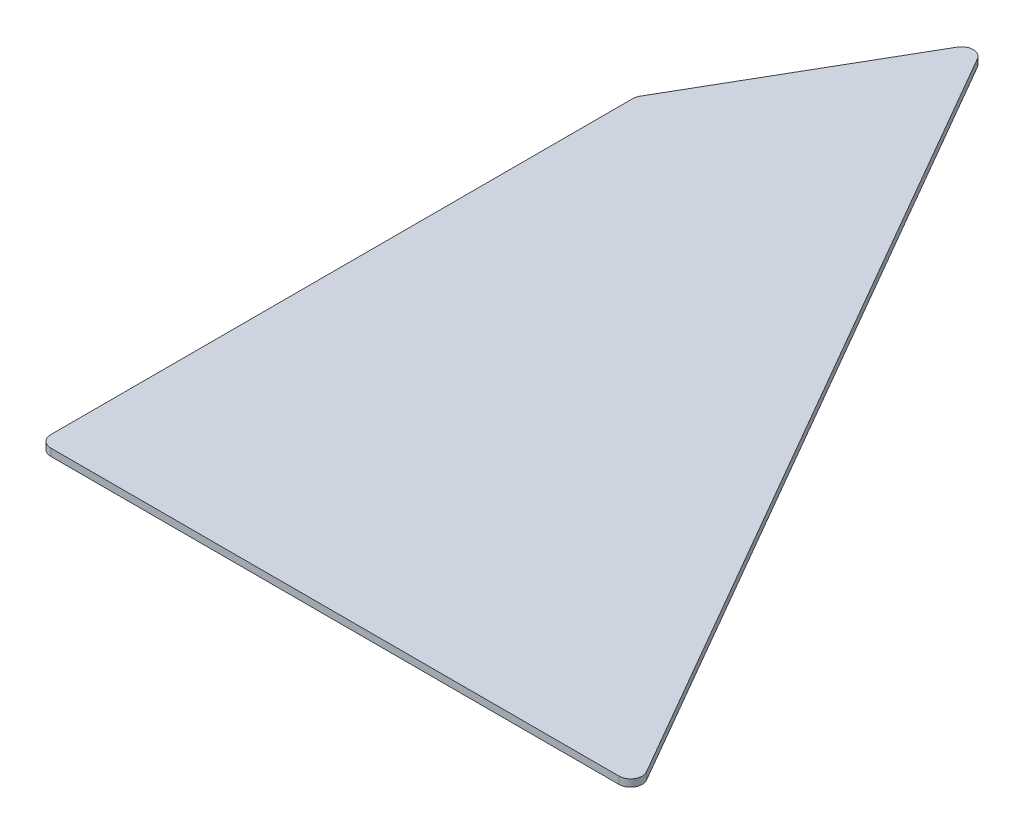
ISO-10303-21;
HEADER;
FILE_DESCRIPTION(('STEP AP214'),'2;1');
FILE_NAME('part.step','',(''),(''),'','','');
FILE_SCHEMA(('AUTOMOTIVE_DESIGN { 1 0 10303 214 1 1 1 1 }'));
ENDSEC;
DATA;
#1=APPLICATION_CONTEXT('core data for automotive mechanical design processes');
#2=APPLICATION_PROTOCOL_DEFINITION('international standard','automotive_design',2000,#1);
#3=PRODUCT_CONTEXT('',#1,'mechanical');
#4=PRODUCT('Part','Part','',(#3));
#5=PRODUCT_RELATED_PRODUCT_CATEGORY('part','',(#4));
#6=PRODUCT_DEFINITION_FORMATION('','',#4);
#7=PRODUCT_DEFINITION_CONTEXT('part definition',#1,'design');
#8=PRODUCT_DEFINITION('design','',#6,#7);
#9=PRODUCT_DEFINITION_SHAPE('','',#8);
#10=(LENGTH_UNIT() NAMED_UNIT(*) SI_UNIT(.MILLI.,.METRE.));
#11=(NAMED_UNIT(*) PLANE_ANGLE_UNIT() SI_UNIT($,.RADIAN.));
#12=(NAMED_UNIT(*) SI_UNIT($,.STERADIAN.) SOLID_ANGLE_UNIT());
#13=UNCERTAINTY_MEASURE_WITH_UNIT(LENGTH_MEASURE(1.E-05),#10,'distance_accuracy_value','');
#14=(GEOMETRIC_REPRESENTATION_CONTEXT(3) GLOBAL_UNCERTAINTY_ASSIGNED_CONTEXT((#13)) GLOBAL_UNIT_ASSIGNED_CONTEXT((#10,
#11,#12)) REPRESENTATION_CONTEXT('',''));
#15=CARTESIAN_POINT('',(0.,0.,0.));
#16=DIRECTION('',(0.,0.,1.));
#17=DIRECTION('',(1.,0.,0.));
#18=AXIS2_PLACEMENT_3D('',#15,#16,#17);
#19=CARTESIAN_POINT('',(172.72,6.35,0.));
#20=DIRECTION('',(-1.,0.,0.));
#21=DIRECTION('',(0.,0.,1.));
#22=AXIS2_PLACEMENT_3D('',#19,#20,#21);
#23=PLANE('',#22);
#24=DIRECTION('',(0.,0.,-1.));
#25=VECTOR('',#24,1.);
#26=CARTESIAN_POINT('',(172.72,6.35,0.));
#27=LINE('',#26,#25);
#28=CARTESIAN_POINT('',(172.72,6.35,-17.78));
#29=VERTEX_POINT('',#28);
#30=CARTESIAN_POINT('',(172.72,6.35,-272.398633585746));
#31=VERTEX_POINT('',#30);
#32=EDGE_CURVE('E132',#29,#31,#27,.T.);
#33=ORIENTED_EDGE('',*,*,#32,.T.);
#34=DIRECTION('',(0.,-1.,0.));
#35=VECTOR('',#34,1.);
#36=CARTESIAN_POINT('',(172.72,3.175,-272.398633585746));
#37=LINE('',#36,#35);
#38=CARTESIAN_POINT('',(172.72,3.175,-272.398633585746));
#39=VERTEX_POINT('',#38);
#40=EDGE_CURVE('E215',#31,#39,#37,.T.);
#41=ORIENTED_EDGE('',*,*,#40,.T.);
#42=DIRECTION('',(0.,0.,-1.));
#43=VECTOR('',#42,1.);
#44=CARTESIAN_POINT('',(172.72,3.175,0.));
#45=LINE('',#44,#43);
#46=CARTESIAN_POINT('',(172.72,3.175,-17.78));
#47=VERTEX_POINT('',#46);
#48=EDGE_CURVE('E158',#47,#39,#45,.T.);
#49=ORIENTED_EDGE('',*,*,#48,.F.);
#50=DIRECTION('',(0.,-1.,0.));
#51=VECTOR('',#50,1.);
#52=CARTESIAN_POINT('',(172.72,6.35,-17.78));
#53=LINE('',#52,#51);
#54=EDGE_CURVE('E213',#47,#29,#53,.F.);
#55=ORIENTED_EDGE('',*,*,#54,.T.);
#56=EDGE_LOOP('',(#33,#41,#49,#55));
#57=FACE_BOUND('',#56,.T.);
#58=ADVANCED_FACE('F33',(#57),#23,.T.);
#59=CARTESIAN_POINT('',(0.,6.35,-12.7));
#60=DIRECTION('',(0.,0.,-1.));
#61=DIRECTION('',(-1.,0.,0.));
#62=AXIS2_PLACEMENT_3D('',#59,#60,#61);
#63=PLANE('',#62);
#64=DIRECTION('',(1.,0.,0.));
#65=VECTOR('',#64,1.);
#66=CARTESIAN_POINT('',(0.,6.35,-12.7));
#67=LINE('',#66,#65);
#68=CARTESIAN_POINT('',(177.8,6.35,-12.7));
#69=VERTEX_POINT('',#68);
#70=CARTESIAN_POINT('',(426.404136641425,6.35,-12.7));
#71=VERTEX_POINT('',#70);
#72=EDGE_CURVE('E180',#69,#71,#67,.T.);
#73=ORIENTED_EDGE('',*,*,#72,.F.);
#74=DIRECTION('',(0.,-1.,0.));
#75=VECTOR('',#74,1.);
#76=CARTESIAN_POINT('',(177.8,3.175,-12.7));
#77=LINE('',#76,#75);
#78=CARTESIAN_POINT('',(177.8,3.175,-12.7));
#79=VERTEX_POINT('',#78);
#80=EDGE_CURVE('E11',#69,#79,#77,.T.);
#81=ORIENTED_EDGE('',*,*,#80,.T.);
#82=DIRECTION('',(1.,0.,0.));
#83=VECTOR('',#82,1.);
#84=CARTESIAN_POINT('',(0.,3.175,-12.7));
#85=LINE('',#84,#83);
#86=CARTESIAN_POINT('',(426.404136641425,3.175,-12.7));
#87=VERTEX_POINT('',#86);
#88=EDGE_CURVE('E161',#79,#87,#85,.T.);
#89=ORIENTED_EDGE('',*,*,#88,.T.);
#90=DIRECTION('',(0.,-1.,0.));
#91=VECTOR('',#90,1.);
#92=CARTESIAN_POINT('',(426.404136641425,6.35,-12.7));
#93=LINE('',#92,#91);
#94=EDGE_CURVE('E41',#87,#71,#93,.F.);
#95=ORIENTED_EDGE('',*,*,#94,.T.);
#96=EDGE_LOOP('',(#73,#81,#89,#95));
#97=FACE_BOUND('',#96,.T.);
#98=ADVANCED_FACE('F228',(#97),#63,.F.);
#99=CARTESIAN_POINT('',(331.901477371938,6.35,-191.623407305123));
#100=DIRECTION('',(-0.866025403784439,0.,0.5));
#101=DIRECTION('',(0.5,0.,0.866025403784439));
#102=AXIS2_PLACEMENT_3D('',#99,#100,#101);
#103=PLANE('',#102);
#104=DIRECTION('',(-0.5,0.,-0.866025403784439));
#105=VECTOR('',#104,1.);
#106=CARTESIAN_POINT('',(331.901477371938,3.175,-191.623407305123));
#107=LINE('',#106,#105);
#108=CARTESIAN_POINT('',(430.80354569265,3.175,-20.3199999999999));
#109=VERTEX_POINT('',#108);
#110=CARTESIAN_POINT('',(232.999409051225,3.175,-362.926814610245));
#111=VERTEX_POINT('',#110);
#112=EDGE_CURVE('E163',#109,#111,#107,.T.);
#113=ORIENTED_EDGE('',*,*,#112,.T.);
#114=DIRECTION('',(0.,-1.,0.));
#115=VECTOR('',#114,1.);
#116=CARTESIAN_POINT('',(232.999409051225,6.35,-362.926814610245));
#117=LINE('',#116,#115);
#118=CARTESIAN_POINT('',(232.999409051225,6.35,-362.926814610245));
#119=VERTEX_POINT('',#118);
#120=EDGE_CURVE('E204',#111,#119,#117,.F.);
#121=ORIENTED_EDGE('',*,*,#120,.T.);
#122=DIRECTION('',(-0.5,0.,-0.866025403784439));
#123=VECTOR('',#122,1.);
#124=CARTESIAN_POINT('',(331.901477371938,6.35,-191.623407305123));
#125=LINE('',#124,#123);
#126=CARTESIAN_POINT('',(430.80354569265,6.35,-20.3199999999999));
#127=VERTEX_POINT('',#126);
#128=EDGE_CURVE('E182',#127,#119,#125,.T.);
#129=ORIENTED_EDGE('',*,*,#128,.F.);
#130=DIRECTION('',(0.,-1.,0.));
#131=VECTOR('',#130,1.);
#132=CARTESIAN_POINT('',(430.80354569265,6.35,-20.32));
#133=LINE('',#132,#131);
#134=EDGE_CURVE('E201',#127,#109,#133,.T.);
#135=ORIENTED_EDGE('',*,*,#134,.T.);
#136=EDGE_LOOP('',(#113,#121,#129,#135));
#137=FACE_BOUND('',#136,.T.);
#138=ADVANCED_FACE('F236',(#137),#103,.F.);
#139=CARTESIAN_POINT('',(10.9985226280624,6.35,6.35000000000001));
#140=DIRECTION('',(0.866025403784439,0.,0.5));
#141=DIRECTION('',(0.5,0.,-0.866025403784439));
#142=AXIS2_PLACEMENT_3D('',#139,#140,#141);
#143=PLANE('',#142);
#144=DIRECTION('',(-0.5,0.,0.866025403784439));
#145=VECTOR('',#144,1.);
#146=CARTESIAN_POINT('',(10.9985226280624,6.35,6.35000000000001));
#147=LINE('',#146,#145);
#148=CARTESIAN_POINT('',(224.200590948775,6.35,-362.926814610245));
#149=VERTEX_POINT('',#148);
#150=CARTESIAN_POINT('',(173.400590948775,6.35,-274.938633585746));
#151=VERTEX_POINT('',#150);
#152=EDGE_CURVE('E185',#149,#151,#147,.T.);
#153=ORIENTED_EDGE('',*,*,#152,.F.);
#154=DIRECTION('',(0.,-1.,0.));
#155=VECTOR('',#154,1.);
#156=CARTESIAN_POINT('',(224.200590948775,6.35,-362.926814610245));
#157=LINE('',#156,#155);
#158=CARTESIAN_POINT('',(224.200590948775,3.175,-362.926814610245));
#159=VERTEX_POINT('',#158);
#160=EDGE_CURVE('E190',#149,#159,#157,.T.);
#161=ORIENTED_EDGE('',*,*,#160,.T.);
#162=DIRECTION('',(-0.5,0.,0.866025403784439));
#163=VECTOR('',#162,1.);
#164=CARTESIAN_POINT('',(10.9985226280624,3.175,6.35000000000001));
#165=LINE('',#164,#163);
#166=CARTESIAN_POINT('',(173.400590948775,3.175,-274.938633585746));
#167=VERTEX_POINT('',#166);
#168=EDGE_CURVE('E166',#159,#167,#165,.T.);
#169=ORIENTED_EDGE('',*,*,#168,.T.);
#170=DIRECTION('',(0.,-1.,0.));
#171=VECTOR('',#170,1.);
#172=CARTESIAN_POINT('',(173.400590948775,6.35,-274.938633585746));
#173=LINE('',#172,#171);
#174=EDGE_CURVE('E188',#167,#151,#173,.F.);
#175=ORIENTED_EDGE('',*,*,#174,.T.);
#176=EDGE_LOOP('',(#153,#161,#169,#175));
#177=FACE_BOUND('',#176,.T.);
#178=ADVANCED_FACE('F244',(#177),#143,.F.);
#179=CARTESIAN_POINT('',(0.,6.35,0.));
#180=DIRECTION('',(0.,1.,0.));
#181=DIRECTION('',(0.,0.,1.));
#182=AXIS2_PLACEMENT_3D('',#179,#180,#181);
#183=PLANE('',#182);
#184=ORIENTED_EDGE('',*,*,#128,.T.);
#185=CARTESIAN_POINT('',(228.6,6.35,-360.386814610245));
#186=DIRECTION('',(0.,1.,0.));
#187=DIRECTION('',(0.,0.,1.));
#188=AXIS2_PLACEMENT_3D('',#185,#186,#187);
#189=CIRCLE('',#188,5.08);
#190=EDGE_CURVE('E211',#119,#149,#189,.T.);
#191=ORIENTED_EDGE('',*,*,#190,.T.);
#192=ORIENTED_EDGE('',*,*,#152,.T.);
#193=CARTESIAN_POINT('',(177.8,6.35,-272.398633585746));
#194=DIRECTION('',(0.,1.,0.));
#195=DIRECTION('',(0.,0.,1.));
#196=AXIS2_PLACEMENT_3D('',#193,#194,#195);
#197=CIRCLE('',#196,5.08);
#198=EDGE_CURVE('E209',#151,#31,#197,.T.);
#199=ORIENTED_EDGE('',*,*,#198,.T.);
#200=ORIENTED_EDGE('',*,*,#32,.F.);
#201=CARTESIAN_POINT('',(177.8,6.35,-17.78));
#202=DIRECTION('',(0.,1.,0.));
#203=DIRECTION('',(0.,0.,1.));
#204=AXIS2_PLACEMENT_3D('',#201,#202,#203);
#205=CIRCLE('',#204,5.08);
#206=EDGE_CURVE('E54',#29,#69,#205,.T.);
#207=ORIENTED_EDGE('',*,*,#206,.T.);
#208=ORIENTED_EDGE('',*,*,#72,.T.);
#209=CARTESIAN_POINT('',(426.404136641425,6.35,-17.78));
#210=DIRECTION('',(0.,1.,0.));
#211=DIRECTION('',(0.,0.,1.));
#212=AXIS2_PLACEMENT_3D('',#209,#210,#211);
#213=CIRCLE('',#212,5.08);
#214=EDGE_CURVE('E206',#71,#127,#213,.T.);
#215=ORIENTED_EDGE('',*,*,#214,.T.);
#216=EDGE_LOOP('',(#184,#191,#192,#199,#200,#207,#208,#215));
#217=FACE_BOUND('',#216,.T.);
#218=ADVANCED_FACE('F230',(#217),#183,.T.);
#219=CARTESIAN_POINT('',(0.,3.175,-25.4));
#220=DIRECTION('',(0.,0.,-1.));
#221=DIRECTION('',(-1.,0.,0.));
#222=AXIS2_PLACEMENT_3D('',#219,#220,#221);
#223=PLANE('',#222);
#224=DIRECTION('',(1.,0.,0.));
#225=VECTOR('',#224,1.);
#226=CARTESIAN_POINT('',(0.,0.,-25.4));
#227=LINE('',#226,#225);
#228=CARTESIAN_POINT('',(185.42,0.,-25.4));
#229=VERTEX_POINT('',#228);
#230=CARTESIAN_POINT('',(413.205909487751,0.,-25.4));
#231=VERTEX_POINT('',#230);
#232=EDGE_CURVE('E169',#229,#231,#227,.T.);
#233=ORIENTED_EDGE('',*,*,#232,.T.);
#234=DIRECTION('',(0.,-1.,0.));
#235=VECTOR('',#234,1.);
#236=CARTESIAN_POINT('',(413.20590948775,3.175,-25.4));
#237=LINE('',#236,#235);
#238=CARTESIAN_POINT('',(413.20590948775,3.175,-25.4));
#239=VERTEX_POINT('',#238);
#240=EDGE_CURVE('E148',#239,#231,#237,.T.);
#241=ORIENTED_EDGE('',*,*,#240,.F.);
#242=DIRECTION('',(1.,0.,0.));
#243=VECTOR('',#242,1.);
#244=CARTESIAN_POINT('',(0.,3.175,-25.4));
#245=LINE('',#244,#243);
#246=CARTESIAN_POINT('',(185.42,3.175,-25.4));
#247=VERTEX_POINT('',#246);
#248=EDGE_CURVE('E141',#247,#239,#245,.T.);
#249=ORIENTED_EDGE('',*,*,#248,.F.);
#250=DIRECTION('',(0.,-1.,0.));
#251=VECTOR('',#250,1.);
#252=CARTESIAN_POINT('',(185.42,3.175,-25.4));
#253=LINE('',#252,#251);
#254=EDGE_CURVE('E122',#247,#229,#253,.T.);
#255=ORIENTED_EDGE('',*,*,#254,.T.);
#256=EDGE_LOOP('',(#233,#241,#249,#255));
#257=FACE_BOUND('',#256,.T.);
#258=ADVANCED_FACE('F146',(#257),#223,.F.);
#259=CARTESIAN_POINT('',(185.42,3.175,0.));
#260=DIRECTION('',(-1.,0.,0.));
#261=DIRECTION('',(0.,0.,1.));
#262=AXIS2_PLACEMENT_3D('',#259,#260,#261);
#263=PLANE('',#262);
#264=DIRECTION('',(0.,0.,-1.));
#265=VECTOR('',#264,1.);
#266=CARTESIAN_POINT('',(185.42,0.,0.));
#267=LINE('',#266,#265);
#268=CARTESIAN_POINT('',(185.42,0.,-270.356860739421));
#269=VERTEX_POINT('',#268);
#270=EDGE_CURVE('E128',#229,#269,#267,.T.);
#271=ORIENTED_EDGE('',*,*,#270,.F.);
#272=ORIENTED_EDGE('',*,*,#254,.F.);
#273=DIRECTION('',(0.,0.,-1.));
#274=VECTOR('',#273,1.);
#275=CARTESIAN_POINT('',(185.42,3.175,0.));
#276=LINE('',#275,#274);
#277=CARTESIAN_POINT('',(185.42,3.175,-270.356860739421));
#278=VERTEX_POINT('',#277);
#279=EDGE_CURVE('E125',#247,#278,#276,.T.);
#280=ORIENTED_EDGE('',*,*,#279,.T.);
#281=DIRECTION('',(0.,-1.,0.));
#282=VECTOR('',#281,1.);
#283=CARTESIAN_POINT('',(185.42,3.175,-270.356860739421));
#284=LINE('',#283,#282);
#285=EDGE_CURVE('E133',#278,#269,#284,.T.);
#286=ORIENTED_EDGE('',*,*,#285,.T.);
#287=EDGE_LOOP('',(#271,#272,#280,#286));
#288=FACE_BOUND('',#287,.T.);
#289=ADVANCED_FACE('F124',(#288),#263,.T.);
#290=CARTESIAN_POINT('',(21.9970452561245,3.175,12.6999999999999));
#291=DIRECTION('',(0.866025403784438,0.,0.500000000000001));
#292=DIRECTION('',(0.500000000000001,0.,-0.866025403784438));
#293=AXIS2_PLACEMENT_3D('',#290,#291,#292);
#294=PLANE('',#293);
#295=DIRECTION('',(-0.500000000000001,0.,0.866025403784438));
#296=VECTOR('',#295,1.);
#297=CARTESIAN_POINT('',(21.9970452561245,0.,12.6999999999999));
#298=LINE('',#297,#296);
#299=CARTESIAN_POINT('',(228.6,0.,-345.146814610245));
#300=VERTEX_POINT('',#299);
#301=EDGE_CURVE('E152',#300,#269,#298,.T.);
#302=ORIENTED_EDGE('',*,*,#301,.T.);
#303=ORIENTED_EDGE('',*,*,#285,.F.);
#304=DIRECTION('',(-0.500000000000001,0.,0.866025403784438));
#305=VECTOR('',#304,1.);
#306=CARTESIAN_POINT('',(21.9970452561245,3.175,12.6999999999999));
#307=LINE('',#306,#305);
#308=CARTESIAN_POINT('',(228.6,3.175,-345.146814610245));
#309=VERTEX_POINT('',#308);
#310=EDGE_CURVE('E144',#309,#278,#307,.T.);
#311=ORIENTED_EDGE('',*,*,#310,.F.);
#312=DIRECTION('',(0.,-1.,0.));
#313=VECTOR('',#312,1.);
#314=CARTESIAN_POINT('',(228.6,3.175,-345.146814610245));
#315=LINE('',#314,#313);
#316=EDGE_CURVE('E175',#309,#300,#315,.T.);
#317=ORIENTED_EDGE('',*,*,#316,.T.);
#318=EDGE_LOOP('',(#302,#303,#311,#317));
#319=FACE_BOUND('',#318,.T.);
#320=ADVANCED_FACE('F275',(#319),#294,.F.);
#321=CARTESIAN_POINT('',(320.902954743875,3.175,-185.273407305123));
#322=DIRECTION('',(-0.866025403784439,0.,0.5));
#323=DIRECTION('',(0.5,0.,0.866025403784439));
#324=AXIS2_PLACEMENT_3D('',#321,#322,#323);
#325=PLANE('',#324);
#326=DIRECTION('',(-0.5,0.,-0.866025403784439));
#327=VECTOR('',#326,1.);
#328=CARTESIAN_POINT('',(320.902954743875,0.,-185.273407305123));
#329=LINE('',#328,#327);
#330=EDGE_CURVE('E149',#231,#300,#329,.T.);
#331=ORIENTED_EDGE('',*,*,#330,.T.);
#332=ORIENTED_EDGE('',*,*,#316,.F.);
#333=DIRECTION('',(-0.5,0.,-0.866025403784439));
#334=VECTOR('',#333,1.);
#335=CARTESIAN_POINT('',(320.902954743875,3.175,-185.273407305123));
#336=LINE('',#335,#334);
#337=EDGE_CURVE('E156',#239,#309,#336,.T.);
#338=ORIENTED_EDGE('',*,*,#337,.F.);
#339=ORIENTED_EDGE('',*,*,#240,.T.);
#340=EDGE_LOOP('',(#331,#332,#338,#339));
#341=FACE_BOUND('',#340,.T.);
#342=ADVANCED_FACE('F278',(#341),#325,.F.);
#343=CARTESIAN_POINT('',(0.,3.175,0.));
#344=DIRECTION('',(0.,1.,0.));
#345=DIRECTION('',(0.,0.,1.));
#346=AXIS2_PLACEMENT_3D('',#343,#344,#345);
#347=PLANE('',#346);
#348=ORIENTED_EDGE('',*,*,#248,.T.);
#349=ORIENTED_EDGE('',*,*,#337,.T.);
#350=ORIENTED_EDGE('',*,*,#310,.T.);
#351=ORIENTED_EDGE('',*,*,#279,.F.);
#352=EDGE_LOOP('',(#348,#349,#350,#351));
#353=FACE_BOUND('',#352,.T.);
#354=ORIENTED_EDGE('',*,*,#168,.F.);
#355=CARTESIAN_POINT('',(228.6,3.175,-360.386814610245));
#356=DIRECTION('',(0.,1.,0.));
#357=DIRECTION('',(0.,0.,1.));
#358=AXIS2_PLACEMENT_3D('',#355,#356,#357);
#359=CIRCLE('',#358,5.08);
#360=EDGE_CURVE('E199',#159,#111,#359,.F.);
#361=ORIENTED_EDGE('',*,*,#360,.T.);
#362=ORIENTED_EDGE('',*,*,#112,.F.);
#363=CARTESIAN_POINT('',(426.404136641425,3.175,-17.78));
#364=DIRECTION('',(0.,1.,0.));
#365=DIRECTION('',(0.,0.,1.));
#366=AXIS2_PLACEMENT_3D('',#363,#364,#365);
#367=CIRCLE('',#366,5.08);
#368=EDGE_CURVE('E193',#109,#87,#367,.F.);
#369=ORIENTED_EDGE('',*,*,#368,.T.);
#370=ORIENTED_EDGE('',*,*,#88,.F.);
#371=CARTESIAN_POINT('',(177.8,3.175,-17.78));
#372=DIRECTION('',(0.,1.,0.));
#373=DIRECTION('',(0.,0.,1.));
#374=AXIS2_PLACEMENT_3D('',#371,#372,#373);
#375=CIRCLE('',#374,5.08);
#376=EDGE_CURVE('E195',#79,#47,#375,.F.);
#377=ORIENTED_EDGE('',*,*,#376,.T.);
#378=ORIENTED_EDGE('',*,*,#48,.T.);
#379=CARTESIAN_POINT('',(177.8,3.175,-272.398633585746));
#380=DIRECTION('',(0.,1.,0.));
#381=DIRECTION('',(0.,0.,1.));
#382=AXIS2_PLACEMENT_3D('',#379,#380,#381);
#383=CIRCLE('',#382,5.08);
#384=EDGE_CURVE('E197',#39,#167,#383,.F.);
#385=ORIENTED_EDGE('',*,*,#384,.T.);
#386=EDGE_LOOP('',(#354,#361,#362,#369,#370,#377,#378,#385));
#387=FACE_BOUND('',#386,.T.);
#388=ADVANCED_FACE('F138',(#353,#387),#347,.F.);
#389=CARTESIAN_POINT('',(0.,0.,0.));
#390=DIRECTION('',(0.,1.,0.));
#391=DIRECTION('',(0.,0.,1.));
#392=AXIS2_PLACEMENT_3D('',#389,#390,#391);
#393=PLANE('',#392);
#394=ORIENTED_EDGE('',*,*,#330,.F.);
#395=ORIENTED_EDGE('',*,*,#232,.F.);
#396=ORIENTED_EDGE('',*,*,#270,.T.);
#397=ORIENTED_EDGE('',*,*,#301,.F.);
#398=EDGE_LOOP('',(#394,#395,#396,#397));
#399=FACE_BOUND('',#398,.T.);
#400=ADVANCED_FACE('F253',(#399),#393,.F.);
#401=CARTESIAN_POINT('',(228.6,6.35,-360.386814610245));
#402=DIRECTION('',(0.,-1.,0.));
#403=DIRECTION('',(0.,0.,-1.));
#404=AXIS2_PLACEMENT_3D('',#401,#402,#403);
#405=CYLINDRICAL_SURFACE('',#404,5.08);
#406=ORIENTED_EDGE('',*,*,#190,.F.);
#407=ORIENTED_EDGE('',*,*,#120,.F.);
#408=ORIENTED_EDGE('',*,*,#360,.F.);
#409=ORIENTED_EDGE('',*,*,#160,.F.);
#410=EDGE_LOOP('',(#406,#407,#408,#409));
#411=FACE_BOUND('',#410,.T.);
#412=ADVANCED_FACE('F241',(#411),#405,.T.);
#413=CARTESIAN_POINT('',(177.8,6.35,-272.398633585746));
#414=DIRECTION('',(0.,1.,0.));
#415=DIRECTION('',(0.,0.,1.));
#416=AXIS2_PLACEMENT_3D('',#413,#414,#415);
#417=CYLINDRICAL_SURFACE('',#416,5.08);
#418=ORIENTED_EDGE('',*,*,#198,.F.);
#419=ORIENTED_EDGE('',*,*,#174,.F.);
#420=ORIENTED_EDGE('',*,*,#384,.F.);
#421=ORIENTED_EDGE('',*,*,#40,.F.);
#422=EDGE_LOOP('',(#418,#419,#420,#421));
#423=FACE_BOUND('',#422,.T.);
#424=ADVANCED_FACE('F246',(#423),#417,.T.);
#425=CARTESIAN_POINT('',(177.8,6.35,-17.78));
#426=DIRECTION('',(0.,1.,0.));
#427=DIRECTION('',(0.,0.,1.));
#428=AXIS2_PLACEMENT_3D('',#425,#426,#427);
#429=CYLINDRICAL_SURFACE('',#428,5.08);
#430=ORIENTED_EDGE('',*,*,#206,.F.);
#431=ORIENTED_EDGE('',*,*,#54,.F.);
#432=ORIENTED_EDGE('',*,*,#376,.F.);
#433=ORIENTED_EDGE('',*,*,#80,.F.);
#434=EDGE_LOOP('',(#430,#431,#432,#433));
#435=FACE_BOUND('',#434,.T.);
#436=ADVANCED_FACE('F227',(#435),#429,.T.);
#437=CARTESIAN_POINT('',(426.404136641425,6.35,-17.78));
#438=DIRECTION('',(0.,-1.,0.));
#439=DIRECTION('',(0.,0.,-1.));
#440=AXIS2_PLACEMENT_3D('',#437,#438,#439);
#441=CYLINDRICAL_SURFACE('',#440,5.08);
#442=ORIENTED_EDGE('',*,*,#214,.F.);
#443=ORIENTED_EDGE('',*,*,#94,.F.);
#444=ORIENTED_EDGE('',*,*,#368,.F.);
#445=ORIENTED_EDGE('',*,*,#134,.F.);
#446=EDGE_LOOP('',(#442,#443,#444,#445));
#447=FACE_BOUND('',#446,.T.);
#448=ADVANCED_FACE('F35',(#447),#441,.T.);
#449=CLOSED_SHELL('',(#58,#98,#138,#178,#218,#258,#289,#320,#342,#388,#400,#412,#424,#436,#448));
#450=MANIFOLD_SOLID_BREP('B2',#449);
#451=ADVANCED_BREP_SHAPE_REPRESENTATION('',(#18,#450),#14);
#452=SHAPE_DEFINITION_REPRESENTATION(#9,#451);
ENDSEC;
END-ISO-10303-21;
